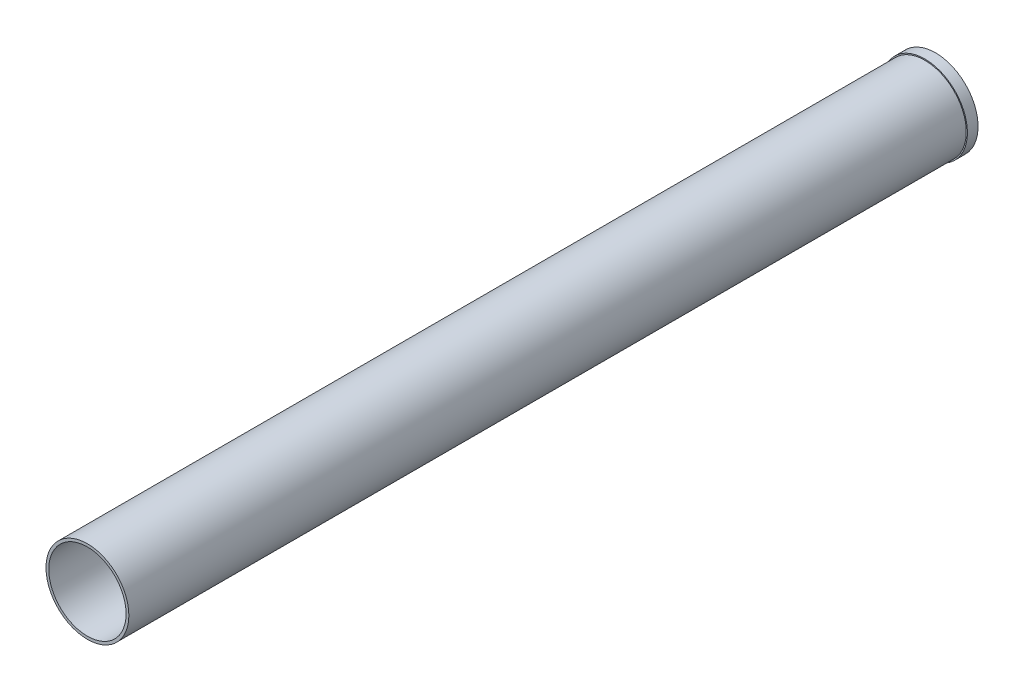
ISO-10303-21;
HEADER;
FILE_DESCRIPTION(('STEP AP214'),'2;1');
FILE_NAME('part.step','',(''),(''),'','','');
FILE_SCHEMA(('AUTOMOTIVE_DESIGN { 1 0 10303 214 1 1 1 1 }'));
ENDSEC;
DATA;
#1=APPLICATION_CONTEXT('core data for automotive mechanical design processes');
#2=APPLICATION_PROTOCOL_DEFINITION('international standard','automotive_design',2000,#1);
#3=PRODUCT_CONTEXT('',#1,'mechanical');
#4=PRODUCT('Part','Part','',(#3));
#5=PRODUCT_RELATED_PRODUCT_CATEGORY('part','',(#4));
#6=PRODUCT_DEFINITION_FORMATION('','',#4);
#7=PRODUCT_DEFINITION_CONTEXT('part definition',#1,'design');
#8=PRODUCT_DEFINITION('design','',#6,#7);
#9=PRODUCT_DEFINITION_SHAPE('','',#8);
#10=(LENGTH_UNIT() NAMED_UNIT(*) SI_UNIT(.MILLI.,.METRE.));
#11=(NAMED_UNIT(*) PLANE_ANGLE_UNIT() SI_UNIT($,.RADIAN.));
#12=(NAMED_UNIT(*) SI_UNIT($,.STERADIAN.) SOLID_ANGLE_UNIT());
#13=UNCERTAINTY_MEASURE_WITH_UNIT(LENGTH_MEASURE(1.E-05),#10,'distance_accuracy_value','');
#14=(GEOMETRIC_REPRESENTATION_CONTEXT(3) GLOBAL_UNCERTAINTY_ASSIGNED_CONTEXT((#13)) GLOBAL_UNIT_ASSIGNED_CONTEXT((#10,
#11,#12)) REPRESENTATION_CONTEXT('',''));
#15=CARTESIAN_POINT('',(0.,0.,0.));
#16=DIRECTION('',(0.,0.,1.));
#17=DIRECTION('',(1.,0.,0.));
#18=AXIS2_PLACEMENT_3D('',#15,#16,#17);
#19=CARTESIAN_POINT('',(0.,0.,1009.65));
#20=DIRECTION('',(0.,0.,-1.));
#21=DIRECTION('',(-1.,0.,0.));
#22=AXIS2_PLACEMENT_3D('',#19,#20,#21);
#23=CYLINDRICAL_SURFACE('',#22,49.3141);
#24=CARTESIAN_POINT('',(0.,0.,1009.65));
#25=DIRECTION('',(0.,0.,1.));
#26=DIRECTION('',(1.,0.,0.));
#27=AXIS2_PLACEMENT_3D('',#24,#25,#26);
#28=CIRCLE('',#27,49.3141);
#29=CARTESIAN_POINT('',(49.3141,0.,1009.65));
#30=VERTEX_POINT('',#29);
#31=EDGE_CURVE('E38',#30,#30,#28,.T.);
#32=ORIENTED_EDGE('',*,*,#31,.F.);
#33=EDGE_LOOP('',(#32));
#34=FACE_BOUND('',#33,.T.);
#35=CARTESIAN_POINT('',(0.,0.,12.7));
#36=DIRECTION('',(0.,0.,-1.));
#37=DIRECTION('',(-1.,0.,0.));
#38=AXIS2_PLACEMENT_3D('',#35,#36,#37);
#39=CIRCLE('',#38,49.3141);
#40=CARTESIAN_POINT('',(-49.3141,0.,12.7));
#41=VERTEX_POINT('',#40);
#42=EDGE_CURVE('E10',#41,#41,#39,.T.);
#43=ORIENTED_EDGE('',*,*,#42,.F.);
#44=EDGE_LOOP('',(#43));
#45=FACE_BOUND('',#44,.T.);
#46=ADVANCED_FACE('F32',(#34,#45),#23,.T.);
#47=CARTESIAN_POINT('',(0.,0.,1009.65));
#48=DIRECTION('',(0.,0.,1.));
#49=DIRECTION('',(1.,0.,0.));
#50=AXIS2_PLACEMENT_3D('',#47,#48,#49);
#51=PLANE('',#50);
#52=ORIENTED_EDGE('',*,*,#31,.T.);
#53=EDGE_LOOP('',(#52));
#54=FACE_BOUND('',#53,.T.);
#55=CARTESIAN_POINT('',(0.,0.,1009.65));
#56=DIRECTION('',(0.,0.,1.));
#57=DIRECTION('',(1.,0.,0.));
#58=AXIS2_PLACEMENT_3D('',#55,#56,#57);
#59=CIRCLE('',#58,46.0502);
#60=CARTESIAN_POINT('',(46.0502,0.,1009.65));
#61=VERTEX_POINT('',#60);
#62=EDGE_CURVE('E42',#61,#61,#59,.T.);
#63=ORIENTED_EDGE('',*,*,#62,.F.);
#64=EDGE_LOOP('',(#63));
#65=FACE_BOUND('',#64,.T.);
#66=ADVANCED_FACE('F70',(#54,#65),#51,.T.);
#67=CARTESIAN_POINT('',(0.,0.,0.));
#68=DIRECTION('',(0.,0.,1.));
#69=DIRECTION('',(1.,0.,0.));
#70=AXIS2_PLACEMENT_3D('',#67,#68,#69);
#71=PLANE('',#70);
#72=CARTESIAN_POINT('',(0.,0.,0.));
#73=DIRECTION('',(0.,0.,1.));
#74=DIRECTION('',(1.,0.,0.));
#75=AXIS2_PLACEMENT_3D('',#72,#73,#74);
#76=CIRCLE('',#75,46.0502);
#77=CARTESIAN_POINT('',(46.0502,0.,0.));
#78=VERTEX_POINT('',#77);
#79=EDGE_CURVE('E46',#78,#78,#76,.T.);
#80=ORIENTED_EDGE('',*,*,#79,.T.);
#81=EDGE_LOOP('',(#80));
#82=FACE_BOUND('',#81,.T.);
#83=CARTESIAN_POINT('',(0.,0.,0.));
#84=DIRECTION('',(0.,0.,-1.));
#85=DIRECTION('',(-1.,0.,0.));
#86=AXIS2_PLACEMENT_3D('',#83,#84,#85);
#87=CIRCLE('',#86,50.673);
#88=CARTESIAN_POINT('',(-50.673,0.,0.));
#89=VERTEX_POINT('',#88);
#90=EDGE_CURVE('E52',#89,#89,#87,.T.);
#91=ORIENTED_EDGE('',*,*,#90,.T.);
#92=EDGE_LOOP('',(#91));
#93=FACE_BOUND('',#92,.T.);
#94=ADVANCED_FACE('F75',(#82,#93),#71,.F.);
#95=CARTESIAN_POINT('',(0.,0.,1009.65));
#96=DIRECTION('',(0.,0.,-1.));
#97=DIRECTION('',(-1.,0.,0.));
#98=AXIS2_PLACEMENT_3D('',#95,#96,#97);
#99=CYLINDRICAL_SURFACE('',#98,46.0502);
#100=ORIENTED_EDGE('',*,*,#62,.T.);
#101=EDGE_LOOP('',(#100));
#102=FACE_BOUND('',#101,.T.);
#103=ORIENTED_EDGE('',*,*,#79,.F.);
#104=EDGE_LOOP('',(#103));
#105=FACE_BOUND('',#104,.T.);
#106=ADVANCED_FACE('F67',(#102,#105),#99,.F.);
#107=CARTESIAN_POINT('',(0.,0.,12.7));
#108=DIRECTION('',(0.,0.,-1.));
#109=DIRECTION('',(-1.,0.,0.));
#110=AXIS2_PLACEMENT_3D('',#107,#108,#109);
#111=CYLINDRICAL_SURFACE('',#110,50.673);
#112=CARTESIAN_POINT('',(0.,0.,12.7));
#113=DIRECTION('',(0.,0.,-1.));
#114=DIRECTION('',(-1.,0.,0.));
#115=AXIS2_PLACEMENT_3D('',#112,#113,#114);
#116=CIRCLE('',#115,50.673);
#117=CARTESIAN_POINT('',(-50.673,0.,12.7));
#118=VERTEX_POINT('',#117);
#119=EDGE_CURVE('E50',#118,#118,#116,.T.);
#120=ORIENTED_EDGE('',*,*,#119,.T.);
#121=EDGE_LOOP('',(#120));
#122=FACE_BOUND('',#121,.T.);
#123=ORIENTED_EDGE('',*,*,#90,.F.);
#124=EDGE_LOOP('',(#123));
#125=FACE_BOUND('',#124,.T.);
#126=ADVANCED_FACE('F58',(#122,#125),#111,.T.);
#127=CARTESIAN_POINT('',(0.,0.,12.7));
#128=DIRECTION('',(0.,0.,-1.));
#129=DIRECTION('',(-1.,0.,0.));
#130=AXIS2_PLACEMENT_3D('',#127,#128,#129);
#131=PLANE('',#130);
#132=ORIENTED_EDGE('',*,*,#42,.T.);
#133=EDGE_LOOP('',(#132));
#134=FACE_BOUND('',#133,.T.);
#135=ORIENTED_EDGE('',*,*,#119,.F.);
#136=EDGE_LOOP('',(#135));
#137=FACE_BOUND('',#136,.T.);
#138=ADVANCED_FACE('F61',(#134,#137),#131,.F.);
#139=CLOSED_SHELL('',(#46,#66,#94,#106,#126,#138));
#140=MANIFOLD_SOLID_BREP('B2',#139);
#141=ADVANCED_BREP_SHAPE_REPRESENTATION('',(#18,#140),#14);
#142=SHAPE_DEFINITION_REPRESENTATION(#9,#141);
ENDSEC;
END-ISO-10303-21;
